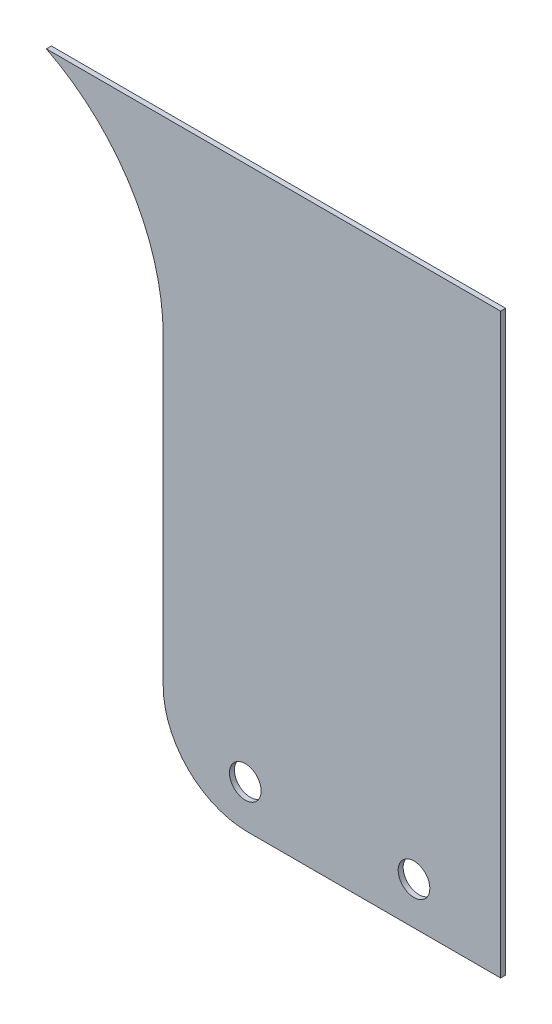
ISO-10303-21;
HEADER;
FILE_DESCRIPTION(('STEP AP214'),'2;1');
FILE_NAME('part.step','',(''),(''),'','','');
FILE_SCHEMA(('AUTOMOTIVE_DESIGN { 1 0 10303 214 1 1 1 1 }'));
ENDSEC;
DATA;
#1=APPLICATION_CONTEXT('core data for automotive mechanical design processes');
#2=APPLICATION_PROTOCOL_DEFINITION('international standard','automotive_design',2000,#1);
#3=PRODUCT_CONTEXT('',#1,'mechanical');
#4=PRODUCT('Part','Part','',(#3));
#5=PRODUCT_RELATED_PRODUCT_CATEGORY('part','',(#4));
#6=PRODUCT_DEFINITION_FORMATION('','',#4);
#7=PRODUCT_DEFINITION_CONTEXT('part definition',#1,'design');
#8=PRODUCT_DEFINITION('design','',#6,#7);
#9=PRODUCT_DEFINITION_SHAPE('','',#8);
#10=(LENGTH_UNIT() NAMED_UNIT(*) SI_UNIT(.MILLI.,.METRE.));
#11=(NAMED_UNIT(*) PLANE_ANGLE_UNIT() SI_UNIT($,.RADIAN.));
#12=(NAMED_UNIT(*) SI_UNIT($,.STERADIAN.) SOLID_ANGLE_UNIT());
#13=UNCERTAINTY_MEASURE_WITH_UNIT(LENGTH_MEASURE(1.E-05),#10,'distance_accuracy_value','');
#14=(GEOMETRIC_REPRESENTATION_CONTEXT(3) GLOBAL_UNCERTAINTY_ASSIGNED_CONTEXT((#13)) GLOBAL_UNIT_ASSIGNED_CONTEXT((#10,
#11,#12)) REPRESENTATION_CONTEXT('',''));
#15=CARTESIAN_POINT('',(0.,0.,0.));
#16=DIRECTION('',(0.,0.,1.));
#17=DIRECTION('',(1.,0.,0.));
#18=AXIS2_PLACEMENT_3D('',#15,#16,#17);
#19=CARTESIAN_POINT('',(-494.375,813.93,166.6));
#20=DIRECTION('',(0.,0.,-1.));
#21=DIRECTION('',(-1.,0.,0.));
#22=AXIS2_PLACEMENT_3D('',#19,#20,#21);
#23=PLANE('',#22);
#24=CARTESIAN_POINT('',(-444.2625,801.23,166.6));
#25=DIRECTION('',(0.,0.,1.));
#26=DIRECTION('',(1.,0.,0.));
#27=AXIS2_PLACEMENT_3D('',#24,#25,#26);
#28=CIRCLE('',#27,4.76250000000003);
#29=CARTESIAN_POINT('',(-439.5,801.23,166.6));
#30=VERTEX_POINT('',#29);
#31=EDGE_CURVE('E122',#30,#30,#28,.T.);
#32=ORIENTED_EDGE('',*,*,#31,.F.);
#33=EDGE_LOOP('',(#32));
#34=FACE_BOUND('',#33,.T.);
#35=DIRECTION('',(0.,1.,0.));
#36=VECTOR('',#35,1.);
#37=CARTESIAN_POINT('',(-418.175,962.43,166.6));
#38=LINE('',#37,#36);
#39=CARTESIAN_POINT('',(-418.175,788.53,166.6));
#40=VERTEX_POINT('',#39);
#41=CARTESIAN_POINT('',(-418.175,962.43,166.6));
#42=VERTEX_POINT('',#41);
#43=EDGE_CURVE('E129',#40,#42,#38,.T.);
#44=ORIENTED_EDGE('',*,*,#43,.T.);
#45=DIRECTION('',(-1.,0.,0.));
#46=VECTOR('',#45,1.);
#47=CARTESIAN_POINT('',(-418.175,962.43,166.6));
#48=LINE('',#47,#46);
#49=CARTESIAN_POINT('',(-554.955743447679,962.43,166.6));
#50=VERTEX_POINT('',#49);
#51=EDGE_CURVE('E87',#42,#50,#48,.T.);
#52=ORIENTED_EDGE('',*,*,#51,.T.);
#53=CARTESIAN_POINT('',(-584.19999999997,905.024825288133,166.6));
#54=DIRECTION('',(0.,0.,-1.));
#55=DIRECTION('',(1.,0.,0.));
#56=AXIS2_PLACEMENT_3D('',#53,#54,#55);
#57=CIRCLE('',#56,64.42499999997);
#58=CARTESIAN_POINT('',(-519.775,905.024825288133,166.6));
#59=VERTEX_POINT('',#58);
#60=EDGE_CURVE('E100',#50,#59,#57,.T.);
#61=ORIENTED_EDGE('',*,*,#60,.T.);
#62=DIRECTION('',(0.,-1.,0.));
#63=VECTOR('',#62,1.);
#64=CARTESIAN_POINT('',(-519.775,813.93,166.6));
#65=LINE('',#64,#63);
#66=CARTESIAN_POINT('',(-519.775,813.93,166.6));
#67=VERTEX_POINT('',#66);
#68=EDGE_CURVE('E94',#59,#67,#65,.T.);
#69=ORIENTED_EDGE('',*,*,#68,.T.);
#70=CARTESIAN_POINT('',(-494.375,813.93,166.6));
#71=DIRECTION('',(0.,0.,1.));
#72=DIRECTION('',(-1.,0.,0.));
#73=AXIS2_PLACEMENT_3D('',#70,#71,#72);
#74=CIRCLE('',#73,25.4);
#75=CARTESIAN_POINT('',(-494.375,788.53,166.6));
#76=VERTEX_POINT('',#75);
#77=EDGE_CURVE('E98',#67,#76,#74,.T.);
#78=ORIENTED_EDGE('',*,*,#77,.T.);
#79=DIRECTION('',(1.,0.,0.));
#80=VECTOR('',#79,1.);
#81=CARTESIAN_POINT('',(-418.175,788.53,166.6));
#82=LINE('',#81,#80);
#83=EDGE_CURVE('E50',#76,#40,#82,.T.);
#84=ORIENTED_EDGE('',*,*,#83,.T.);
#85=EDGE_LOOP('',(#44,#52,#61,#69,#78,#84));
#86=FACE_BOUND('',#85,.T.);
#87=CARTESIAN_POINT('',(-495.0625,801.23,166.6));
#88=DIRECTION('',(0.,0.,1.));
#89=DIRECTION('',(1.,0.,0.));
#90=AXIS2_PLACEMENT_3D('',#87,#88,#89);
#91=CIRCLE('',#90,4.76250000000003);
#92=CARTESIAN_POINT('',(-490.3,801.23,166.6));
#93=VERTEX_POINT('',#92);
#94=EDGE_CURVE('E172',#93,#93,#91,.T.);
#95=ORIENTED_EDGE('',*,*,#94,.F.);
#96=EDGE_LOOP('',(#95));
#97=FACE_BOUND('',#96,.T.);
#98=ADVANCED_FACE('F33',(#34,#86,#97),#23,.F.);
#99=CARTESIAN_POINT('',(-494.375,813.93,165.1));
#100=DIRECTION('',(0.,0.,-1.));
#101=DIRECTION('',(-1.,0.,0.));
#102=AXIS2_PLACEMENT_3D('',#99,#100,#101);
#103=PLANE('',#102);
#104=CARTESIAN_POINT('',(-444.2625,801.23,165.1));
#105=DIRECTION('',(0.,0.,1.));
#106=DIRECTION('',(1.,0.,0.));
#107=AXIS2_PLACEMENT_3D('',#104,#105,#106);
#108=CIRCLE('',#107,4.76250000000003);
#109=CARTESIAN_POINT('',(-439.5,801.23,165.1));
#110=VERTEX_POINT('',#109);
#111=EDGE_CURVE('E177',#110,#110,#108,.T.);
#112=ORIENTED_EDGE('',*,*,#111,.T.);
#113=EDGE_LOOP('',(#112));
#114=FACE_BOUND('',#113,.T.);
#115=DIRECTION('',(0.,1.,0.));
#116=VECTOR('',#115,1.);
#117=CARTESIAN_POINT('',(-418.175,962.43,165.1));
#118=LINE('',#117,#116);
#119=CARTESIAN_POINT('',(-418.175,788.53,165.1));
#120=VERTEX_POINT('',#119);
#121=CARTESIAN_POINT('',(-418.175,962.43,165.1));
#122=VERTEX_POINT('',#121);
#123=EDGE_CURVE('E118',#120,#122,#118,.T.);
#124=ORIENTED_EDGE('',*,*,#123,.F.);
#125=DIRECTION('',(1.,0.,0.));
#126=VECTOR('',#125,1.);
#127=CARTESIAN_POINT('',(-418.175,788.53,165.1));
#128=LINE('',#127,#126);
#129=CARTESIAN_POINT('',(-494.375,788.53,165.1));
#130=VERTEX_POINT('',#129);
#131=EDGE_CURVE('E79',#130,#120,#128,.T.);
#132=ORIENTED_EDGE('',*,*,#131,.F.);
#133=CARTESIAN_POINT('',(-494.375,813.93,165.1));
#134=DIRECTION('',(0.,0.,1.));
#135=DIRECTION('',(-1.,0.,0.));
#136=AXIS2_PLACEMENT_3D('',#133,#134,#135);
#137=CIRCLE('',#136,25.4);
#138=CARTESIAN_POINT('',(-519.775,813.93,165.1));
#139=VERTEX_POINT('',#138);
#140=EDGE_CURVE('E73',#139,#130,#137,.T.);
#141=ORIENTED_EDGE('',*,*,#140,.F.);
#142=DIRECTION('',(0.,-1.,0.));
#143=VECTOR('',#142,1.);
#144=CARTESIAN_POINT('',(-519.775,813.93,165.1));
#145=LINE('',#144,#143);
#146=CARTESIAN_POINT('',(-519.775,905.024825288133,165.1));
#147=VERTEX_POINT('',#146);
#148=EDGE_CURVE('E108',#147,#139,#145,.T.);
#149=ORIENTED_EDGE('',*,*,#148,.F.);
#150=CARTESIAN_POINT('',(-584.19999999997,905.024825288133,165.1));
#151=DIRECTION('',(0.,0.,-1.));
#152=DIRECTION('',(1.,0.,0.));
#153=AXIS2_PLACEMENT_3D('',#150,#151,#152);
#154=CIRCLE('',#153,64.42499999997);
#155=CARTESIAN_POINT('',(-554.955743447679,962.43,165.1));
#156=VERTEX_POINT('',#155);
#157=EDGE_CURVE('E124',#156,#147,#154,.T.);
#158=ORIENTED_EDGE('',*,*,#157,.F.);
#159=DIRECTION('',(-1.,0.,0.));
#160=VECTOR('',#159,1.);
#161=CARTESIAN_POINT('',(-418.175,962.43,165.1));
#162=LINE('',#161,#160);
#163=EDGE_CURVE('E121',#122,#156,#162,.T.);
#164=ORIENTED_EDGE('',*,*,#163,.F.);
#165=EDGE_LOOP('',(#124,#132,#141,#149,#158,#164));
#166=FACE_BOUND('',#165,.T.);
#167=CARTESIAN_POINT('',(-495.0625,801.23,165.1));
#168=DIRECTION('',(0.,0.,1.));
#169=DIRECTION('',(1.,0.,0.));
#170=AXIS2_PLACEMENT_3D('',#167,#168,#169);
#171=CIRCLE('',#170,4.76250000000003);
#172=CARTESIAN_POINT('',(-490.3,801.23,165.1));
#173=VERTEX_POINT('',#172);
#174=EDGE_CURVE('E175',#173,#173,#171,.T.);
#175=ORIENTED_EDGE('',*,*,#174,.T.);
#176=EDGE_LOOP('',(#175));
#177=FACE_BOUND('',#176,.T.);
#178=ADVANCED_FACE('F138',(#114,#166,#177),#103,.T.);
#179=CARTESIAN_POINT('',(-418.175,962.43,166.6));
#180=DIRECTION('',(-1.,0.,0.));
#181=DIRECTION('',(0.,0.,1.));
#182=AXIS2_PLACEMENT_3D('',#179,#180,#181);
#183=PLANE('',#182);
#184=ORIENTED_EDGE('',*,*,#123,.T.);
#185=DIRECTION('',(0.,0.,-1.));
#186=VECTOR('',#185,1.);
#187=CARTESIAN_POINT('',(-418.175,962.43,166.6));
#188=LINE('',#187,#186);
#189=EDGE_CURVE('E11',#42,#122,#188,.T.);
#190=ORIENTED_EDGE('',*,*,#189,.F.);
#191=ORIENTED_EDGE('',*,*,#43,.F.);
#192=DIRECTION('',(0.,0.,-1.));
#193=VECTOR('',#192,1.);
#194=CARTESIAN_POINT('',(-418.175,788.53,166.6));
#195=LINE('',#194,#193);
#196=EDGE_CURVE('E114',#40,#120,#195,.T.);
#197=ORIENTED_EDGE('',*,*,#196,.T.);
#198=EDGE_LOOP('',(#184,#190,#191,#197));
#199=FACE_BOUND('',#198,.T.);
#200=ADVANCED_FACE('F35',(#199),#183,.F.);
#201=CARTESIAN_POINT('',(-418.175,962.43,166.6));
#202=DIRECTION('',(0.,-1.,0.));
#203=DIRECTION('',(0.,0.,-1.));
#204=AXIS2_PLACEMENT_3D('',#201,#202,#203);
#205=PLANE('',#204);
#206=ORIENTED_EDGE('',*,*,#163,.T.);
#207=DIRECTION('',(0.,0.,-1.));
#208=VECTOR('',#207,1.);
#209=CARTESIAN_POINT('',(-554.955743447679,962.43,166.6));
#210=LINE('',#209,#208);
#211=EDGE_CURVE('E42',#50,#156,#210,.T.);
#212=ORIENTED_EDGE('',*,*,#211,.F.);
#213=ORIENTED_EDGE('',*,*,#51,.F.);
#214=ORIENTED_EDGE('',*,*,#189,.T.);
#215=EDGE_LOOP('',(#206,#212,#213,#214));
#216=FACE_BOUND('',#215,.T.);
#217=ADVANCED_FACE('F218',(#216),#205,.F.);
#218=CARTESIAN_POINT('',(-584.19999999997,905.024825288133,166.6));
#219=DIRECTION('',(0.,0.,-1.));
#220=DIRECTION('',(-1.,0.,0.));
#221=AXIS2_PLACEMENT_3D('',#218,#219,#220);
#222=CYLINDRICAL_SURFACE('',#221,64.42499999997);
#223=ORIENTED_EDGE('',*,*,#157,.T.);
#224=DIRECTION('',(0.,0.,-1.));
#225=VECTOR('',#224,1.);
#226=CARTESIAN_POINT('',(-519.775,905.024825288133,166.6));
#227=LINE('',#226,#225);
#228=EDGE_CURVE('E109',#59,#147,#227,.T.);
#229=ORIENTED_EDGE('',*,*,#228,.F.);
#230=ORIENTED_EDGE('',*,*,#60,.F.);
#231=ORIENTED_EDGE('',*,*,#211,.T.);
#232=EDGE_LOOP('',(#223,#229,#230,#231));
#233=FACE_BOUND('',#232,.T.);
#234=ADVANCED_FACE('F135',(#233),#222,.F.);
#235=CARTESIAN_POINT('',(-519.775,813.93,166.6));
#236=DIRECTION('',(1.,0.,0.));
#237=DIRECTION('',(0.,0.,-1.));
#238=AXIS2_PLACEMENT_3D('',#235,#236,#237);
#239=PLANE('',#238);
#240=ORIENTED_EDGE('',*,*,#148,.T.);
#241=DIRECTION('',(0.,0.,-1.));
#242=VECTOR('',#241,1.);
#243=CARTESIAN_POINT('',(-519.775,813.93,166.6));
#244=LINE('',#243,#242);
#245=EDGE_CURVE('E105',#67,#139,#244,.T.);
#246=ORIENTED_EDGE('',*,*,#245,.F.);
#247=ORIENTED_EDGE('',*,*,#68,.F.);
#248=ORIENTED_EDGE('',*,*,#228,.T.);
#249=EDGE_LOOP('',(#240,#246,#247,#248));
#250=FACE_BOUND('',#249,.T.);
#251=ADVANCED_FACE('F106',(#250),#239,.F.);
#252=CARTESIAN_POINT('',(-494.375,813.93,166.6));
#253=DIRECTION('',(0.,0.,-1.));
#254=DIRECTION('',(-1.,0.,0.));
#255=AXIS2_PLACEMENT_3D('',#252,#253,#254);
#256=CYLINDRICAL_SURFACE('',#255,25.4);
#257=ORIENTED_EDGE('',*,*,#140,.T.);
#258=DIRECTION('',(0.,0.,-1.));
#259=VECTOR('',#258,1.);
#260=CARTESIAN_POINT('',(-494.375,788.53,166.6));
#261=LINE('',#260,#259);
#262=EDGE_CURVE('E110',#76,#130,#261,.T.);
#263=ORIENTED_EDGE('',*,*,#262,.F.);
#264=ORIENTED_EDGE('',*,*,#77,.F.);
#265=ORIENTED_EDGE('',*,*,#245,.T.);
#266=EDGE_LOOP('',(#257,#263,#264,#265));
#267=FACE_BOUND('',#266,.T.);
#268=ADVANCED_FACE('F112',(#267),#256,.T.);
#269=CARTESIAN_POINT('',(-418.175,788.53,166.6));
#270=DIRECTION('',(0.,1.,0.));
#271=DIRECTION('',(0.,0.,1.));
#272=AXIS2_PLACEMENT_3D('',#269,#270,#271);
#273=PLANE('',#272);
#274=ORIENTED_EDGE('',*,*,#131,.T.);
#275=ORIENTED_EDGE('',*,*,#196,.F.);
#276=ORIENTED_EDGE('',*,*,#83,.F.);
#277=ORIENTED_EDGE('',*,*,#262,.T.);
#278=EDGE_LOOP('',(#274,#275,#276,#277));
#279=FACE_BOUND('',#278,.T.);
#280=ADVANCED_FACE('F143',(#279),#273,.F.);
#281=CARTESIAN_POINT('',(-444.2625,801.23,166.6));
#282=DIRECTION('',(0.,0.,-1.));
#283=DIRECTION('',(-1.,0.,0.));
#284=AXIS2_PLACEMENT_3D('',#281,#282,#283);
#285=CYLINDRICAL_SURFACE('',#284,4.76250000000003);
#286=ORIENTED_EDGE('',*,*,#31,.T.);
#287=EDGE_LOOP('',(#286));
#288=FACE_BOUND('',#287,.T.);
#289=ORIENTED_EDGE('',*,*,#111,.F.);
#290=EDGE_LOOP('',(#289));
#291=FACE_BOUND('',#290,.T.);
#292=ADVANCED_FACE('F145',(#288,#291),#285,.F.);
#293=CARTESIAN_POINT('',(-495.0625,801.23,166.6));
#294=DIRECTION('',(0.,0.,-1.));
#295=DIRECTION('',(-1.,0.,0.));
#296=AXIS2_PLACEMENT_3D('',#293,#294,#295);
#297=CYLINDRICAL_SURFACE('',#296,4.76250000000003);
#298=ORIENTED_EDGE('',*,*,#94,.T.);
#299=EDGE_LOOP('',(#298));
#300=FACE_BOUND('',#299,.T.);
#301=ORIENTED_EDGE('',*,*,#174,.F.);
#302=EDGE_LOOP('',(#301));
#303=FACE_BOUND('',#302,.T.);
#304=ADVANCED_FACE('F151',(#300,#303),#297,.F.);
#305=CLOSED_SHELL('',(#98,#178,#200,#217,#234,#251,#268,#280,#292,#304));
#306=MANIFOLD_SOLID_BREP('B2',#305);
#307=ADVANCED_BREP_SHAPE_REPRESENTATION('',(#18,#306),#14);
#308=SHAPE_DEFINITION_REPRESENTATION(#9,#307);
ENDSEC;
END-ISO-10303-21;
